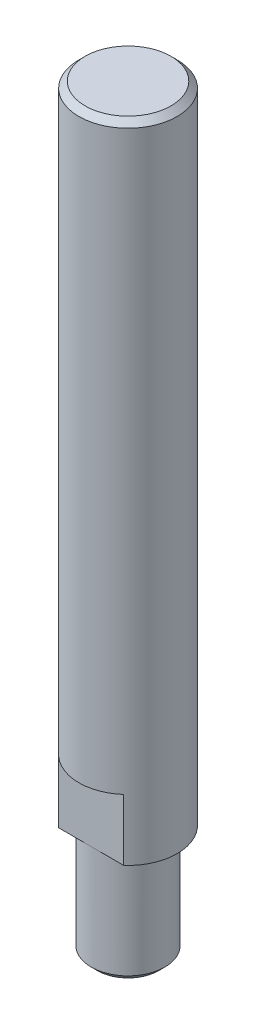
ISO-10303-21;
HEADER;
FILE_DESCRIPTION(('STEP AP214'),'2;1');
FILE_NAME('part.step','',(''),(''),'','','');
FILE_SCHEMA(('AUTOMOTIVE_DESIGN { 1 0 10303 214 1 1 1 1 }'));
ENDSEC;
DATA;
#1=APPLICATION_CONTEXT('core data for automotive mechanical design processes');
#2=APPLICATION_PROTOCOL_DEFINITION('international standard','automotive_design',2000,#1);
#3=PRODUCT_CONTEXT('',#1,'mechanical');
#4=PRODUCT('Part','Part','',(#3));
#5=PRODUCT_RELATED_PRODUCT_CATEGORY('part','',(#4));
#6=PRODUCT_DEFINITION_FORMATION('','',#4);
#7=PRODUCT_DEFINITION_CONTEXT('part definition',#1,'design');
#8=PRODUCT_DEFINITION('design','',#6,#7);
#9=PRODUCT_DEFINITION_SHAPE('','',#8);
#10=(LENGTH_UNIT() NAMED_UNIT(*) SI_UNIT(.MILLI.,.METRE.));
#11=(NAMED_UNIT(*) PLANE_ANGLE_UNIT() SI_UNIT($,.RADIAN.));
#12=(NAMED_UNIT(*) SI_UNIT($,.STERADIAN.) SOLID_ANGLE_UNIT());
#13=UNCERTAINTY_MEASURE_WITH_UNIT(LENGTH_MEASURE(1.E-05),#10,'distance_accuracy_value','');
#14=(GEOMETRIC_REPRESENTATION_CONTEXT(3) GLOBAL_UNCERTAINTY_ASSIGNED_CONTEXT((#13)) GLOBAL_UNIT_ASSIGNED_CONTEXT((#10,
#11,#12)) REPRESENTATION_CONTEXT('',''));
#15=CARTESIAN_POINT('',(0.,0.,0.));
#16=DIRECTION('',(0.,0.,1.));
#17=DIRECTION('',(1.,0.,0.));
#18=AXIS2_PLACEMENT_3D('',#15,#16,#17);
#19=CARTESIAN_POINT('',(0.,105.,0.));
#20=DIRECTION('',(0.,-1.,0.));
#21=DIRECTION('',(0.,0.,-1.));
#22=AXIS2_PLACEMENT_3D('',#19,#20,#21);
#23=CYLINDRICAL_SURFACE('',#22,8.);
#24=CARTESIAN_POINT('',(0.,104.,0.));
#25=DIRECTION('',(0.,1.,0.));
#26=DIRECTION('',(0.,0.,1.));
#27=AXIS2_PLACEMENT_3D('',#24,#25,#26);
#28=CIRCLE('',#27,8.);
#29=CARTESIAN_POINT('',(0.,104.,8.));
#30=VERTEX_POINT('',#29);
#31=EDGE_CURVE('E120',#30,#30,#28,.F.);
#32=ORIENTED_EDGE('',*,*,#31,.T.);
#33=EDGE_LOOP('',(#32));
#34=FACE_BOUND('',#33,.T.);
#35=DIRECTION('',(0.,-1.,0.));
#36=VECTOR('',#35,1.);
#37=CARTESIAN_POINT('',(-5.29150262212918,105.,6.));
#38=LINE('',#37,#36);
#39=CARTESIAN_POINT('',(-5.29150262212918,10.,6.));
#40=VERTEX_POINT('',#39);
#41=CARTESIAN_POINT('',(-5.29150262212918,0.,6.));
#42=VERTEX_POINT('',#41);
#43=EDGE_CURVE('E99',#40,#42,#38,.T.);
#44=ORIENTED_EDGE('',*,*,#43,.F.);
#45=CARTESIAN_POINT('',(0.,9.99999999999999,0.));
#46=DIRECTION('',(0.,-1.,0.));
#47=DIRECTION('',(0.,0.,-1.));
#48=AXIS2_PLACEMENT_3D('',#45,#46,#47);
#49=CIRCLE('',#48,8.);
#50=CARTESIAN_POINT('',(5.29150262212918,10.,6.));
#51=VERTEX_POINT('',#50);
#52=EDGE_CURVE('E12',#51,#40,#49,.T.);
#53=ORIENTED_EDGE('',*,*,#52,.F.);
#54=DIRECTION('',(0.,-1.,0.));
#55=VECTOR('',#54,1.);
#56=CARTESIAN_POINT('',(5.29150262212918,105.,6.));
#57=LINE('',#56,#55);
#58=CARTESIAN_POINT('',(5.29150262212918,0.,6.));
#59=VERTEX_POINT('',#58);
#60=EDGE_CURVE('E85',#59,#51,#57,.F.);
#61=ORIENTED_EDGE('',*,*,#60,.F.);
#62=CARTESIAN_POINT('',(0.,0.,0.));
#63=DIRECTION('',(0.,1.,0.));
#64=DIRECTION('',(0.,0.,1.));
#65=AXIS2_PLACEMENT_3D('',#62,#63,#64);
#66=CIRCLE('',#65,8.);
#67=CARTESIAN_POINT('',(5.29150262212918,0.,-6.));
#68=VERTEX_POINT('',#67);
#69=EDGE_CURVE('E98',#59,#68,#66,.T.);
#70=ORIENTED_EDGE('',*,*,#69,.T.);
#71=DIRECTION('',(0.,-1.,0.));
#72=VECTOR('',#71,1.);
#73=CARTESIAN_POINT('',(5.29150262212918,105.,-6.));
#74=LINE('',#73,#72);
#75=CARTESIAN_POINT('',(5.29150262212918,10.,-6.));
#76=VERTEX_POINT('',#75);
#77=EDGE_CURVE('E100',#76,#68,#74,.T.);
#78=ORIENTED_EDGE('',*,*,#77,.F.);
#79=CARTESIAN_POINT('',(-5.29150262212918,10.,-6.));
#80=VERTEX_POINT('',#79);
#81=EDGE_CURVE('E42',#80,#76,#49,.T.);
#82=ORIENTED_EDGE('',*,*,#81,.F.);
#83=DIRECTION('',(0.,-1.,0.));
#84=VECTOR('',#83,1.);
#85=CARTESIAN_POINT('',(-5.29150262212918,105.,-6.));
#86=LINE('',#85,#84);
#87=CARTESIAN_POINT('',(-5.29150262212918,0.,-6.));
#88=VERTEX_POINT('',#87);
#89=EDGE_CURVE('E131',#88,#80,#86,.F.);
#90=ORIENTED_EDGE('',*,*,#89,.F.);
#91=EDGE_CURVE('E104',#88,#42,#66,.T.);
#92=ORIENTED_EDGE('',*,*,#91,.T.);
#93=EDGE_LOOP('',(#44,#53,#61,#70,#78,#82,#90,#92));
#94=FACE_BOUND('',#93,.T.);
#95=ADVANCED_FACE('F38',(#34,#94),#23,.T.);
#96=CARTESIAN_POINT('',(0.,0.,0.));
#97=DIRECTION('',(0.,1.,0.));
#98=DIRECTION('',(0.,0.,1.));
#99=AXIS2_PLACEMENT_3D('',#96,#97,#98);
#100=PLANE('',#99);
#101=DIRECTION('',(-1.,0.,0.));
#102=VECTOR('',#101,1.);
#103=CARTESIAN_POINT('',(-8.,0.,6.));
#104=LINE('',#103,#102);
#105=CARTESIAN_POINT('',(0.,0.,6.));
#106=VERTEX_POINT('',#105);
#107=EDGE_CURVE('E53',#106,#42,#104,.T.);
#108=ORIENTED_EDGE('',*,*,#107,.T.);
#109=ORIENTED_EDGE('',*,*,#91,.F.);
#110=DIRECTION('',(1.,0.,0.));
#111=VECTOR('',#110,1.);
#112=CARTESIAN_POINT('',(-8.,0.,-6.));
#113=LINE('',#112,#111);
#114=CARTESIAN_POINT('',(0.,0.,-6.));
#115=VERTEX_POINT('',#114);
#116=EDGE_CURVE('E140',#88,#115,#113,.T.);
#117=ORIENTED_EDGE('',*,*,#116,.T.);
#118=CARTESIAN_POINT('',(0.,0.,0.));
#119=DIRECTION('',(0.,-1.,0.));
#120=DIRECTION('',(0.,0.,-1.));
#121=AXIS2_PLACEMENT_3D('',#118,#119,#120);
#122=CIRCLE('',#121,6.);
#123=EDGE_CURVE('E103',#106,#115,#122,.T.);
#124=ORIENTED_EDGE('',*,*,#123,.F.);
#125=EDGE_LOOP('',(#108,#109,#117,#124));
#126=FACE_BOUND('',#125,.T.);
#127=ADVANCED_FACE('F138',(#126),#100,.F.);
#128=EDGE_CURVE('E81',#59,#106,#104,.T.);
#129=ORIENTED_EDGE('',*,*,#128,.T.);
#130=EDGE_CURVE('E107',#115,#106,#122,.T.);
#131=ORIENTED_EDGE('',*,*,#130,.F.);
#132=EDGE_CURVE('E61',#115,#68,#113,.T.);
#133=ORIENTED_EDGE('',*,*,#132,.T.);
#134=ORIENTED_EDGE('',*,*,#69,.F.);
#135=EDGE_LOOP('',(#129,#131,#133,#134));
#136=FACE_BOUND('',#135,.T.);
#137=ADVANCED_FACE('F102',(#136),#100,.F.);
#138=CARTESIAN_POINT('',(0.,105.,0.));
#139=DIRECTION('',(0.,1.,0.));
#140=DIRECTION('',(0.,0.,1.));
#141=AXIS2_PLACEMENT_3D('',#138,#139,#140);
#142=PLANE('',#141);
#143=CARTESIAN_POINT('',(0.,105.,0.));
#144=DIRECTION('',(0.,1.,0.));
#145=DIRECTION('',(0.,0.,1.));
#146=AXIS2_PLACEMENT_3D('',#143,#144,#145);
#147=CIRCLE('',#146,6.99999999999996);
#148=CARTESIAN_POINT('',(0.,105.,6.99999999999996));
#149=VERTEX_POINT('',#148);
#150=EDGE_CURVE('E118',#149,#149,#147,.T.);
#151=ORIENTED_EDGE('',*,*,#150,.T.);
#152=EDGE_LOOP('',(#151));
#153=FACE_BOUND('',#152,.T.);
#154=ADVANCED_FACE('F147',(#153),#142,.T.);
#155=CARTESIAN_POINT('',(0.,-18.,0.));
#156=DIRECTION('',(0.,1.,0.));
#157=DIRECTION('',(0.,0.,1.));
#158=AXIS2_PLACEMENT_3D('',#155,#156,#157);
#159=CYLINDRICAL_SURFACE('',#158,6.);
#160=CARTESIAN_POINT('',(0.,-17.,0.));
#161=DIRECTION('',(0.,-1.,0.));
#162=DIRECTION('',(0.,0.,-1.));
#163=AXIS2_PLACEMENT_3D('',#160,#161,#162);
#164=CIRCLE('',#163,6.);
#165=CARTESIAN_POINT('',(0.,-17.,-6.));
#166=VERTEX_POINT('',#165);
#167=EDGE_CURVE('E115',#166,#166,#164,.F.);
#168=ORIENTED_EDGE('',*,*,#167,.T.);
#169=EDGE_LOOP('',(#168));
#170=FACE_BOUND('',#169,.T.);
#171=ORIENTED_EDGE('',*,*,#130,.T.);
#172=ORIENTED_EDGE('',*,*,#123,.T.);
#173=EDGE_LOOP('',(#171,#172));
#174=FACE_BOUND('',#173,.T.);
#175=ADVANCED_FACE('F144',(#170,#174),#159,.T.);
#176=CARTESIAN_POINT('',(0.,-18.,0.));
#177=DIRECTION('',(0.,-1.,0.));
#178=DIRECTION('',(0.,0.,-1.));
#179=AXIS2_PLACEMENT_3D('',#176,#177,#178);
#180=PLANE('',#179);
#181=CARTESIAN_POINT('',(0.,-18.,0.));
#182=DIRECTION('',(0.,-1.,0.));
#183=DIRECTION('',(0.,0.,-1.));
#184=AXIS2_PLACEMENT_3D('',#181,#182,#183);
#185=CIRCLE('',#184,5.);
#186=CARTESIAN_POINT('',(0.,-18.,-5.));
#187=VERTEX_POINT('',#186);
#188=EDGE_CURVE('E112',#187,#187,#185,.T.);
#189=ORIENTED_EDGE('',*,*,#188,.T.);
#190=EDGE_LOOP('',(#189));
#191=FACE_BOUND('',#190,.T.);
#192=ADVANCED_FACE('F146',(#191),#180,.T.);
#193=CARTESIAN_POINT('',(0.,-18.,0.));
#194=DIRECTION('',(0.,1.,0.));
#195=DIRECTION('',(0.,0.,1.));
#196=AXIS2_PLACEMENT_3D('',#193,#194,#195);
#197=CONICAL_SURFACE('',#196,5.,0.785398163397451);
#198=ORIENTED_EDGE('',*,*,#167,.F.);
#199=EDGE_LOOP('',(#198));
#200=FACE_BOUND('',#199,.T.);
#201=ORIENTED_EDGE('',*,*,#188,.F.);
#202=EDGE_LOOP('',(#201));
#203=FACE_BOUND('',#202,.T.);
#204=ADVANCED_FACE('F154',(#200,#203),#197,.T.);
#205=CARTESIAN_POINT('',(0.,105.,0.));
#206=DIRECTION('',(0.,-1.,0.));
#207=DIRECTION('',(0.,0.,-1.));
#208=AXIS2_PLACEMENT_3D('',#205,#206,#207);
#209=CONICAL_SURFACE('',#208,6.99999999999996,0.785398163397445);
#210=ORIENTED_EDGE('',*,*,#31,.F.);
#211=EDGE_LOOP('',(#210));
#212=FACE_BOUND('',#211,.T.);
#213=ORIENTED_EDGE('',*,*,#150,.F.);
#214=EDGE_LOOP('',(#213));
#215=FACE_BOUND('',#214,.T.);
#216=ADVANCED_FACE('F40',(#212,#215),#209,.T.);
#217=CARTESIAN_POINT('',(-8.,10.,-6.));
#218=DIRECTION('',(0.,0.,-1.));
#219=DIRECTION('',(-1.,0.,0.));
#220=AXIS2_PLACEMENT_3D('',#217,#218,#219);
#221=PLANE('',#220);
#222=ORIENTED_EDGE('',*,*,#77,.T.);
#223=ORIENTED_EDGE('',*,*,#132,.F.);
#224=ORIENTED_EDGE('',*,*,#116,.F.);
#225=ORIENTED_EDGE('',*,*,#89,.T.);
#226=DIRECTION('',(1.,0.,0.));
#227=VECTOR('',#226,1.);
#228=CARTESIAN_POINT('',(-8.,10.,-6.));
#229=LINE('',#228,#227);
#230=EDGE_CURVE('E91',#80,#76,#229,.T.);
#231=ORIENTED_EDGE('',*,*,#230,.T.);
#232=EDGE_LOOP('',(#222,#223,#224,#225,#231));
#233=FACE_BOUND('',#232,.T.);
#234=ADVANCED_FACE('F130',(#233),#221,.T.);
#235=CARTESIAN_POINT('',(0.,10.,0.));
#236=DIRECTION('',(0.,-1.,0.));
#237=DIRECTION('',(0.,0.,-1.));
#238=AXIS2_PLACEMENT_3D('',#235,#236,#237);
#239=PLANE('',#238);
#240=ORIENTED_EDGE('',*,*,#81,.T.);
#241=ORIENTED_EDGE('',*,*,#230,.F.);
#242=EDGE_LOOP('',(#240,#241));
#243=FACE_BOUND('',#242,.T.);
#244=ADVANCED_FACE('F128',(#243),#239,.T.);
#245=ORIENTED_EDGE('',*,*,#52,.T.);
#246=DIRECTION('',(-1.,0.,0.));
#247=VECTOR('',#246,1.);
#248=CARTESIAN_POINT('',(-8.,10.,6.));
#249=LINE('',#248,#247);
#250=EDGE_CURVE('E132',#51,#40,#249,.T.);
#251=ORIENTED_EDGE('',*,*,#250,.F.);
#252=EDGE_LOOP('',(#245,#251));
#253=FACE_BOUND('',#252,.T.);
#254=ADVANCED_FACE('F183',(#253),#239,.T.);
#255=CARTESIAN_POINT('',(-8.,10.,6.));
#256=DIRECTION('',(0.,0.,1.));
#257=DIRECTION('',(1.,0.,0.));
#258=AXIS2_PLACEMENT_3D('',#255,#256,#257);
#259=PLANE('',#258);
#260=ORIENTED_EDGE('',*,*,#43,.T.);
#261=ORIENTED_EDGE('',*,*,#107,.F.);
#262=ORIENTED_EDGE('',*,*,#128,.F.);
#263=ORIENTED_EDGE('',*,*,#60,.T.);
#264=ORIENTED_EDGE('',*,*,#250,.T.);
#265=EDGE_LOOP('',(#260,#261,#262,#263,#264));
#266=FACE_BOUND('',#265,.T.);
#267=ADVANCED_FACE('F83',(#266),#259,.T.);
#268=CLOSED_SHELL('',(#95,#127,#137,#154,#175,#192,#204,#216,#234,#244,#254,#267));
#269=MANIFOLD_SOLID_BREP('B2',#268);
#270=ADVANCED_BREP_SHAPE_REPRESENTATION('',(#18,#269),#14);
#271=SHAPE_DEFINITION_REPRESENTATION(#9,#270);
ENDSEC;
END-ISO-10303-21;
